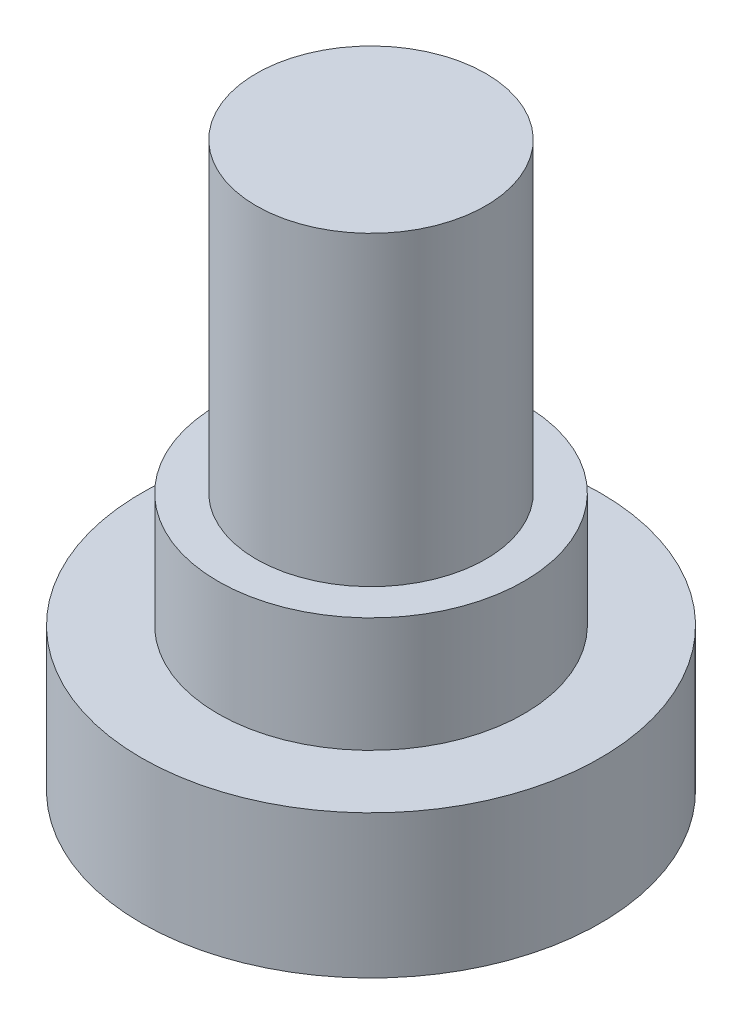
ISO-10303-21;
HEADER;
FILE_DESCRIPTION(('STEP AP214'),'2;1');
FILE_NAME('part.step','',(''),(''),'','','');
FILE_SCHEMA(('AUTOMOTIVE_DESIGN { 1 0 10303 214 1 1 1 1 }'));
ENDSEC;
DATA;
#1=APPLICATION_CONTEXT('core data for automotive mechanical design processes');
#2=APPLICATION_PROTOCOL_DEFINITION('international standard','automotive_design',2000,#1);
#3=PRODUCT_CONTEXT('',#1,'mechanical');
#4=PRODUCT('Part','Part','',(#3));
#5=PRODUCT_RELATED_PRODUCT_CATEGORY('part','',(#4));
#6=PRODUCT_DEFINITION_FORMATION('','',#4);
#7=PRODUCT_DEFINITION_CONTEXT('part definition',#1,'design');
#8=PRODUCT_DEFINITION('design','',#6,#7);
#9=PRODUCT_DEFINITION_SHAPE('','',#8);
#10=(LENGTH_UNIT() NAMED_UNIT(*) SI_UNIT(.MILLI.,.METRE.));
#11=(NAMED_UNIT(*) PLANE_ANGLE_UNIT() SI_UNIT($,.RADIAN.));
#12=(NAMED_UNIT(*) SI_UNIT($,.STERADIAN.) SOLID_ANGLE_UNIT());
#13=UNCERTAINTY_MEASURE_WITH_UNIT(LENGTH_MEASURE(1.E-05),#10,'distance_accuracy_value','');
#14=(GEOMETRIC_REPRESENTATION_CONTEXT(3) GLOBAL_UNCERTAINTY_ASSIGNED_CONTEXT((#13)) GLOBAL_UNIT_ASSIGNED_CONTEXT((#10,
#11,#12)) REPRESENTATION_CONTEXT('',''));
#15=CARTESIAN_POINT('',(0.,0.,0.));
#16=DIRECTION('',(0.,0.,1.));
#17=DIRECTION('',(1.,0.,0.));
#18=AXIS2_PLACEMENT_3D('',#15,#16,#17);
#19=CARTESIAN_POINT('',(0.,3.74,0.));
#20=DIRECTION('',(0.,-1.,0.));
#21=DIRECTION('',(0.,0.,-1.));
#22=AXIS2_PLACEMENT_3D('',#19,#20,#21);
#23=CYLINDRICAL_SURFACE('',#22,6.);
#24=CARTESIAN_POINT('',(0.,3.74,0.));
#25=DIRECTION('',(0.,1.,0.));
#26=DIRECTION('',(0.,0.,1.));
#27=AXIS2_PLACEMENT_3D('',#24,#25,#26);
#28=CIRCLE('',#27,6.);
#29=CARTESIAN_POINT('',(0.,3.74,6.));
#30=VERTEX_POINT('',#29);
#31=EDGE_CURVE('E46',#30,#30,#28,.T.);
#32=ORIENTED_EDGE('',*,*,#31,.F.);
#33=EDGE_LOOP('',(#32));
#34=FACE_BOUND('',#33,.T.);
#35=CARTESIAN_POINT('',(0.,0.,0.));
#36=DIRECTION('',(0.,1.,0.));
#37=DIRECTION('',(0.,0.,1.));
#38=AXIS2_PLACEMENT_3D('',#35,#36,#37);
#39=CIRCLE('',#38,6.);
#40=CARTESIAN_POINT('',(0.,0.,6.));
#41=VERTEX_POINT('',#40);
#42=EDGE_CURVE('E37',#41,#41,#39,.T.);
#43=ORIENTED_EDGE('',*,*,#42,.T.);
#44=EDGE_LOOP('',(#43));
#45=FACE_BOUND('',#44,.T.);
#46=ADVANCED_FACE('F34',(#34,#45),#23,.T.);
#47=CARTESIAN_POINT('',(0.,3.74,0.));
#48=DIRECTION('',(0.,1.,0.));
#49=DIRECTION('',(0.,0.,1.));
#50=AXIS2_PLACEMENT_3D('',#47,#48,#49);
#51=PLANE('',#50);
#52=CARTESIAN_POINT('',(0.,3.74,0.));
#53=DIRECTION('',(0.,1.,0.));
#54=DIRECTION('',(0.,0.,1.));
#55=AXIS2_PLACEMENT_3D('',#52,#53,#54);
#56=CIRCLE('',#55,4.);
#57=CARTESIAN_POINT('',(0.,3.74,4.));
#58=VERTEX_POINT('',#57);
#59=EDGE_CURVE('E41',#58,#58,#56,.T.);
#60=ORIENTED_EDGE('',*,*,#59,.F.);
#61=EDGE_LOOP('',(#60));
#62=FACE_BOUND('',#61,.T.);
#63=ORIENTED_EDGE('',*,*,#31,.T.);
#64=EDGE_LOOP('',(#63));
#65=FACE_BOUND('',#64,.T.);
#66=ADVANCED_FACE('F63',(#62,#65),#51,.T.);
#67=CARTESIAN_POINT('',(0.,0.,0.));
#68=DIRECTION('',(0.,1.,0.));
#69=DIRECTION('',(0.,0.,1.));
#70=AXIS2_PLACEMENT_3D('',#67,#68,#69);
#71=PLANE('',#70);
#72=ORIENTED_EDGE('',*,*,#42,.F.);
#73=EDGE_LOOP('',(#72));
#74=FACE_BOUND('',#73,.T.);
#75=ADVANCED_FACE('F60',(#74),#71,.F.);
#76=CARTESIAN_POINT('',(0.,6.74,0.));
#77=DIRECTION('',(0.,-1.,0.));
#78=DIRECTION('',(0.,0.,-1.));
#79=AXIS2_PLACEMENT_3D('',#76,#77,#78);
#80=CYLINDRICAL_SURFACE('',#79,4.);
#81=CARTESIAN_POINT('',(0.,6.74,0.));
#82=DIRECTION('',(0.,1.,0.));
#83=DIRECTION('',(0.,0.,1.));
#84=AXIS2_PLACEMENT_3D('',#81,#82,#83);
#85=CIRCLE('',#84,4.);
#86=CARTESIAN_POINT('',(0.,6.74,4.));
#87=VERTEX_POINT('',#86);
#88=EDGE_CURVE('E51',#87,#87,#85,.T.);
#89=ORIENTED_EDGE('',*,*,#88,.F.);
#90=EDGE_LOOP('',(#89));
#91=FACE_BOUND('',#90,.T.);
#92=ORIENTED_EDGE('',*,*,#59,.T.);
#93=EDGE_LOOP('',(#92));
#94=FACE_BOUND('',#93,.T.);
#95=ADVANCED_FACE('F62',(#91,#94),#80,.T.);
#96=CARTESIAN_POINT('',(0.,6.74,0.));
#97=DIRECTION('',(0.,1.,0.));
#98=DIRECTION('',(0.,0.,1.));
#99=AXIS2_PLACEMENT_3D('',#96,#97,#98);
#100=PLANE('',#99);
#101=CARTESIAN_POINT('',(0.,6.74,0.));
#102=DIRECTION('',(0.,1.,0.));
#103=DIRECTION('',(0.,0.,1.));
#104=AXIS2_PLACEMENT_3D('',#101,#102,#103);
#105=CIRCLE('',#104,3.);
#106=CARTESIAN_POINT('',(0.,6.74,3.));
#107=VERTEX_POINT('',#106);
#108=EDGE_CURVE('E10',#107,#107,#105,.T.);
#109=ORIENTED_EDGE('',*,*,#108,.F.);
#110=EDGE_LOOP('',(#109));
#111=FACE_BOUND('',#110,.T.);
#112=ORIENTED_EDGE('',*,*,#88,.T.);
#113=EDGE_LOOP('',(#112));
#114=FACE_BOUND('',#113,.T.);
#115=ADVANCED_FACE('F68',(#111,#114),#100,.T.);
#116=CARTESIAN_POINT('',(0.,14.74,0.));
#117=DIRECTION('',(0.,-1.,0.));
#118=DIRECTION('',(0.,0.,-1.));
#119=AXIS2_PLACEMENT_3D('',#116,#117,#118);
#120=CYLINDRICAL_SURFACE('',#119,3.);
#121=CARTESIAN_POINT('',(0.,14.74,0.));
#122=DIRECTION('',(0.,1.,0.));
#123=DIRECTION('',(0.,0.,1.));
#124=AXIS2_PLACEMENT_3D('',#121,#122,#123);
#125=CIRCLE('',#124,3.);
#126=CARTESIAN_POINT('',(0.,14.74,3.));
#127=VERTEX_POINT('',#126);
#128=EDGE_CURVE('E50',#127,#127,#125,.T.);
#129=ORIENTED_EDGE('',*,*,#128,.F.);
#130=EDGE_LOOP('',(#129));
#131=FACE_BOUND('',#130,.T.);
#132=ORIENTED_EDGE('',*,*,#108,.T.);
#133=EDGE_LOOP('',(#132));
#134=FACE_BOUND('',#133,.T.);
#135=ADVANCED_FACE('F98',(#131,#134),#120,.T.);
#136=CARTESIAN_POINT('',(0.,14.74,0.));
#137=DIRECTION('',(0.,1.,0.));
#138=DIRECTION('',(0.,0.,1.));
#139=AXIS2_PLACEMENT_3D('',#136,#137,#138);
#140=PLANE('',#139);
#141=ORIENTED_EDGE('',*,*,#128,.T.);
#142=EDGE_LOOP('',(#141));
#143=FACE_BOUND('',#142,.T.);
#144=ADVANCED_FACE('F108',(#143),#140,.T.);
#145=CLOSED_SHELL('',(#46,#66,#75,#95,#115,#135,#144));
#146=MANIFOLD_SOLID_BREP('B2',#145);
#147=ADVANCED_BREP_SHAPE_REPRESENTATION('',(#18,#146),#14);
#148=SHAPE_DEFINITION_REPRESENTATION(#9,#147);
ENDSEC;
END-ISO-10303-21;
